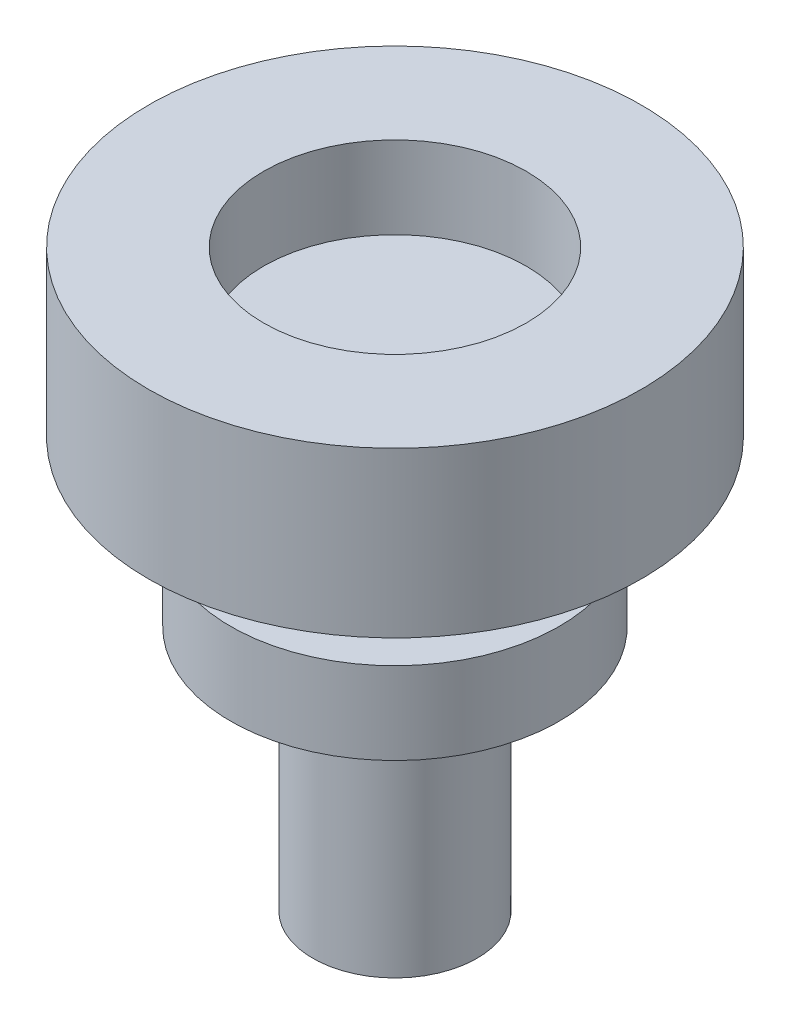
ISO-10303-21;
HEADER;
FILE_DESCRIPTION(('STEP AP214'),'2;1');
FILE_NAME('part.step','',(''),(''),'','','');
FILE_SCHEMA(('AUTOMOTIVE_DESIGN { 1 0 10303 214 1 1 1 1 }'));
ENDSEC;
DATA;
#1=APPLICATION_CONTEXT('core data for automotive mechanical design processes');
#2=APPLICATION_PROTOCOL_DEFINITION('international standard','automotive_design',2000,#1);
#3=PRODUCT_CONTEXT('',#1,'mechanical');
#4=PRODUCT('Part','Part','',(#3));
#5=PRODUCT_RELATED_PRODUCT_CATEGORY('part','',(#4));
#6=PRODUCT_DEFINITION_FORMATION('','',#4);
#7=PRODUCT_DEFINITION_CONTEXT('part definition',#1,'design');
#8=PRODUCT_DEFINITION('design','',#6,#7);
#9=PRODUCT_DEFINITION_SHAPE('','',#8);
#10=(LENGTH_UNIT() NAMED_UNIT(*) SI_UNIT(.MILLI.,.METRE.));
#11=(NAMED_UNIT(*) PLANE_ANGLE_UNIT() SI_UNIT($,.RADIAN.));
#12=(NAMED_UNIT(*) SI_UNIT($,.STERADIAN.) SOLID_ANGLE_UNIT());
#13=UNCERTAINTY_MEASURE_WITH_UNIT(LENGTH_MEASURE(1.E-05),#10,'distance_accuracy_value','');
#14=(GEOMETRIC_REPRESENTATION_CONTEXT(3) GLOBAL_UNCERTAINTY_ASSIGNED_CONTEXT((#13)) GLOBAL_UNIT_ASSIGNED_CONTEXT((#10,
#11,#12)) REPRESENTATION_CONTEXT('',''));
#15=CARTESIAN_POINT('',(0.,0.,0.));
#16=DIRECTION('',(0.,0.,1.));
#17=DIRECTION('',(1.,0.,0.));
#18=AXIS2_PLACEMENT_3D('',#15,#16,#17);
#19=CARTESIAN_POINT('',(-0.522013311509166,2.,-0.51113803418606));
#20=DIRECTION('',(0.,1.,0.));
#21=DIRECTION('',(0.,0.,1.));
#22=AXIS2_PLACEMENT_3D('',#19,#20,#21);
#23=PLANE('',#22);
#24=CARTESIAN_POINT('',(-0.522013311509166,2.,-0.51113803418606));
#25=DIRECTION('',(0.,1.,0.));
#26=DIRECTION('',(0.,0.,1.));
#27=AXIS2_PLACEMENT_3D('',#24,#25,#26);
#28=CIRCLE('',#27,3.);
#29=CARTESIAN_POINT('',(-0.522013311509166,2.,2.48886196581394));
#30=VERTEX_POINT('',#29);
#31=EDGE_CURVE('E71',#30,#30,#28,.T.);
#32=ORIENTED_EDGE('',*,*,#31,.T.);
#33=EDGE_LOOP('',(#32));
#34=FACE_BOUND('',#33,.T.);
#35=CARTESIAN_POINT('',(-0.522013311509166,2.,-0.51113803418606));
#36=DIRECTION('',(0.,1.,0.));
#37=DIRECTION('',(0.,0.,1.));
#38=AXIS2_PLACEMENT_3D('',#35,#36,#37);
#39=CIRCLE('',#38,1.6);
#40=CARTESIAN_POINT('',(-0.522013311509166,2.,1.08886196581394));
#41=VERTEX_POINT('',#40);
#42=EDGE_CURVE('E66',#41,#41,#39,.T.);
#43=ORIENTED_EDGE('',*,*,#42,.F.);
#44=EDGE_LOOP('',(#43));
#45=FACE_BOUND('',#44,.T.);
#46=ADVANCED_FACE('F41',(#34,#45),#23,.T.);
#47=CARTESIAN_POINT('',(-0.522013311509166,0.,-0.51113803418606));
#48=DIRECTION('',(0.,1.,0.));
#49=DIRECTION('',(0.,0.,1.));
#50=AXIS2_PLACEMENT_3D('',#47,#48,#49);
#51=PLANE('',#50);
#52=CARTESIAN_POINT('',(-0.522013311509166,0.,-0.51113803418606));
#53=DIRECTION('',(0.,-1.,0.));
#54=DIRECTION('',(0.,0.,-1.));
#55=AXIS2_PLACEMENT_3D('',#52,#53,#54);
#56=CIRCLE('',#55,1.5);
#57=CARTESIAN_POINT('',(-0.522013311509166,0.,-2.01113803418606));
#58=VERTEX_POINT('',#57);
#59=EDGE_CURVE('E49',#58,#58,#56,.T.);
#60=ORIENTED_EDGE('',*,*,#59,.F.);
#61=EDGE_LOOP('',(#60));
#62=FACE_BOUND('',#61,.T.);
#63=CARTESIAN_POINT('',(-0.522013311509166,0.,-0.51113803418606));
#64=DIRECTION('',(0.,1.,0.));
#65=DIRECTION('',(0.,0.,1.));
#66=AXIS2_PLACEMENT_3D('',#63,#64,#65);
#67=CIRCLE('',#66,3.);
#68=CARTESIAN_POINT('',(-0.522013311509166,0.,2.48886196581394));
#69=VERTEX_POINT('',#68);
#70=EDGE_CURVE('E70',#69,#69,#67,.T.);
#71=ORIENTED_EDGE('',*,*,#70,.F.);
#72=EDGE_LOOP('',(#71));
#73=FACE_BOUND('',#72,.T.);
#74=ADVANCED_FACE('F77',(#62,#73),#51,.F.);
#75=CARTESIAN_POINT('',(-0.522013311509166,2.,-0.51113803418606));
#76=DIRECTION('',(0.,-1.,0.));
#77=DIRECTION('',(0.,0.,-1.));
#78=AXIS2_PLACEMENT_3D('',#75,#76,#77);
#79=CYLINDRICAL_SURFACE('',#78,3.);
#80=ORIENTED_EDGE('',*,*,#31,.F.);
#81=EDGE_LOOP('',(#80));
#82=FACE_BOUND('',#81,.T.);
#83=ORIENTED_EDGE('',*,*,#70,.T.);
#84=EDGE_LOOP('',(#83));
#85=FACE_BOUND('',#84,.T.);
#86=ADVANCED_FACE('F43',(#82,#85),#79,.T.);
#87=CARTESIAN_POINT('',(-0.522013311509166,2.,-0.51113803418606));
#88=DIRECTION('',(0.,-1.,0.));
#89=DIRECTION('',(0.,0.,-1.));
#90=AXIS2_PLACEMENT_3D('',#87,#88,#89);
#91=CYLINDRICAL_SURFACE('',#90,1.6);
#92=CARTESIAN_POINT('',(-0.522013311509166,1.,-0.51113803418606));
#93=DIRECTION('',(0.,1.,0.));
#94=DIRECTION('',(0.,0.,1.));
#95=AXIS2_PLACEMENT_3D('',#92,#93,#94);
#96=CIRCLE('',#95,1.6);
#97=CARTESIAN_POINT('',(-0.522013311509166,1.,1.08886196581394));
#98=VERTEX_POINT('',#97);
#99=EDGE_CURVE('E45',#98,#98,#96,.T.);
#100=ORIENTED_EDGE('',*,*,#99,.F.);
#101=EDGE_LOOP('',(#100));
#102=FACE_BOUND('',#101,.T.);
#103=ORIENTED_EDGE('',*,*,#42,.T.);
#104=EDGE_LOOP('',(#103));
#105=FACE_BOUND('',#104,.T.);
#106=ADVANCED_FACE('F84',(#102,#105),#91,.F.);
#107=CARTESIAN_POINT('',(0.,1.,0.));
#108=DIRECTION('',(0.,1.,0.));
#109=DIRECTION('',(0.,0.,1.));
#110=AXIS2_PLACEMENT_3D('',#107,#108,#109);
#111=PLANE('',#110);
#112=ORIENTED_EDGE('',*,*,#99,.T.);
#113=EDGE_LOOP('',(#112));
#114=FACE_BOUND('',#113,.T.);
#115=ADVANCED_FACE('F92',(#114),#111,.T.);
#116=CARTESIAN_POINT('',(-0.522013311509166,-1.,-0.51113803418606));
#117=DIRECTION('',(0.,1.,0.));
#118=DIRECTION('',(0.,0.,1.));
#119=AXIS2_PLACEMENT_3D('',#116,#117,#118);
#120=CYLINDRICAL_SURFACE('',#119,1.5);
#121=CARTESIAN_POINT('',(-0.522013311509166,-1.,-0.51113803418606));
#122=DIRECTION('',(0.,-1.,0.));
#123=DIRECTION('',(0.,0.,-1.));
#124=AXIS2_PLACEMENT_3D('',#121,#122,#123);
#125=CIRCLE('',#124,1.5);
#126=CARTESIAN_POINT('',(-0.522013311509166,-1.,-2.01113803418606));
#127=VERTEX_POINT('',#126);
#128=EDGE_CURVE('E61',#127,#127,#125,.T.);
#129=ORIENTED_EDGE('',*,*,#128,.F.);
#130=EDGE_LOOP('',(#129));
#131=FACE_BOUND('',#130,.T.);
#132=ORIENTED_EDGE('',*,*,#59,.T.);
#133=EDGE_LOOP('',(#132));
#134=FACE_BOUND('',#133,.T.);
#135=ADVANCED_FACE('F96',(#131,#134),#120,.T.);
#136=CARTESIAN_POINT('',(-0.522013311509166,-2.,-0.51113803418606));
#137=DIRECTION('',(0.,1.,0.));
#138=DIRECTION('',(0.,0.,1.));
#139=AXIS2_PLACEMENT_3D('',#136,#137,#138);
#140=CYLINDRICAL_SURFACE('',#139,2.);
#141=CARTESIAN_POINT('',(-0.522013311509166,-2.,-0.51113803418606));
#142=DIRECTION('',(0.,-1.,0.));
#143=DIRECTION('',(0.,0.,-1.));
#144=AXIS2_PLACEMENT_3D('',#141,#142,#143);
#145=CIRCLE('',#144,2.);
#146=CARTESIAN_POINT('',(-0.522013311509166,-2.,-2.51113803418606));
#147=VERTEX_POINT('',#146);
#148=EDGE_CURVE('E58',#147,#147,#145,.T.);
#149=ORIENTED_EDGE('',*,*,#148,.F.);
#150=EDGE_LOOP('',(#149));
#151=FACE_BOUND('',#150,.T.);
#152=CARTESIAN_POINT('',(-0.522013311509166,-1.,-0.51113803418606));
#153=DIRECTION('',(0.,-1.,0.));
#154=DIRECTION('',(0.,0.,-1.));
#155=AXIS2_PLACEMENT_3D('',#152,#153,#154);
#156=CIRCLE('',#155,2.);
#157=CARTESIAN_POINT('',(-0.522013311509166,-1.,-2.51113803418606));
#158=VERTEX_POINT('',#157);
#159=EDGE_CURVE('E62',#158,#158,#156,.T.);
#160=ORIENTED_EDGE('',*,*,#159,.T.);
#161=EDGE_LOOP('',(#160));
#162=FACE_BOUND('',#161,.T.);
#163=ADVANCED_FACE('F100',(#151,#162),#140,.T.);
#164=CARTESIAN_POINT('',(-0.522013311509166,-2.,-0.51113803418606));
#165=DIRECTION('',(0.,-1.,0.));
#166=DIRECTION('',(0.,0.,-1.));
#167=AXIS2_PLACEMENT_3D('',#164,#165,#166);
#168=PLANE('',#167);
#169=CARTESIAN_POINT('',(-0.522013311509166,-2.,-0.51113803418606));
#170=DIRECTION('',(0.,-1.,0.));
#171=DIRECTION('',(0.,0.,-1.));
#172=AXIS2_PLACEMENT_3D('',#169,#170,#171);
#173=CIRCLE('',#172,1.);
#174=CARTESIAN_POINT('',(-0.522013311509166,-2.,-1.51113803418606));
#175=VERTEX_POINT('',#174);
#176=EDGE_CURVE('E10',#175,#175,#173,.T.);
#177=ORIENTED_EDGE('',*,*,#176,.F.);
#178=EDGE_LOOP('',(#177));
#179=FACE_BOUND('',#178,.T.);
#180=ORIENTED_EDGE('',*,*,#148,.T.);
#181=EDGE_LOOP('',(#180));
#182=FACE_BOUND('',#181,.T.);
#183=ADVANCED_FACE('F104',(#179,#182),#168,.T.);
#184=CARTESIAN_POINT('',(-0.522013311509166,-1.,-0.51113803418606));
#185=DIRECTION('',(0.,-1.,0.));
#186=DIRECTION('',(0.,0.,-1.));
#187=AXIS2_PLACEMENT_3D('',#184,#185,#186);
#188=PLANE('',#187);
#189=ORIENTED_EDGE('',*,*,#128,.T.);
#190=EDGE_LOOP('',(#189));
#191=FACE_BOUND('',#190,.T.);
#192=ORIENTED_EDGE('',*,*,#159,.F.);
#193=EDGE_LOOP('',(#192));
#194=FACE_BOUND('',#193,.T.);
#195=ADVANCED_FACE('F106',(#191,#194),#188,.F.);
#196=CARTESIAN_POINT('',(-0.522013311509166,-5.,-0.51113803418606));
#197=DIRECTION('',(0.,1.,0.));
#198=DIRECTION('',(0.,0.,1.));
#199=AXIS2_PLACEMENT_3D('',#196,#197,#198);
#200=CYLINDRICAL_SURFACE('',#199,1.);
#201=CARTESIAN_POINT('',(-0.522013311509166,-5.,-0.51113803418606));
#202=DIRECTION('',(0.,-1.,0.));
#203=DIRECTION('',(0.,0.,-1.));
#204=AXIS2_PLACEMENT_3D('',#201,#202,#203);
#205=CIRCLE('',#204,1.);
#206=CARTESIAN_POINT('',(-0.522013311509166,-5.,-1.51113803418606));
#207=VERTEX_POINT('',#206);
#208=EDGE_CURVE('E57',#207,#207,#205,.T.);
#209=ORIENTED_EDGE('',*,*,#208,.F.);
#210=EDGE_LOOP('',(#209));
#211=FACE_BOUND('',#210,.T.);
#212=ORIENTED_EDGE('',*,*,#176,.T.);
#213=EDGE_LOOP('',(#212));
#214=FACE_BOUND('',#213,.T.);
#215=ADVANCED_FACE('F109',(#211,#214),#200,.T.);
#216=CARTESIAN_POINT('',(-0.522013311509166,-5.,-0.51113803418606));
#217=DIRECTION('',(0.,-1.,0.));
#218=DIRECTION('',(0.,0.,-1.));
#219=AXIS2_PLACEMENT_3D('',#216,#217,#218);
#220=PLANE('',#219);
#221=ORIENTED_EDGE('',*,*,#208,.T.);
#222=EDGE_LOOP('',(#221));
#223=FACE_BOUND('',#222,.T.);
#224=ADVANCED_FACE('F116',(#223),#220,.T.);
#225=CLOSED_SHELL('',(#46,#74,#86,#106,#115,#135,#163,#183,#195,#215,#224));
#226=MANIFOLD_SOLID_BREP('B2',#225);
#227=ADVANCED_BREP_SHAPE_REPRESENTATION('',(#18,#226),#14);
#228=SHAPE_DEFINITION_REPRESENTATION(#9,#227);
ENDSEC;
END-ISO-10303-21;
